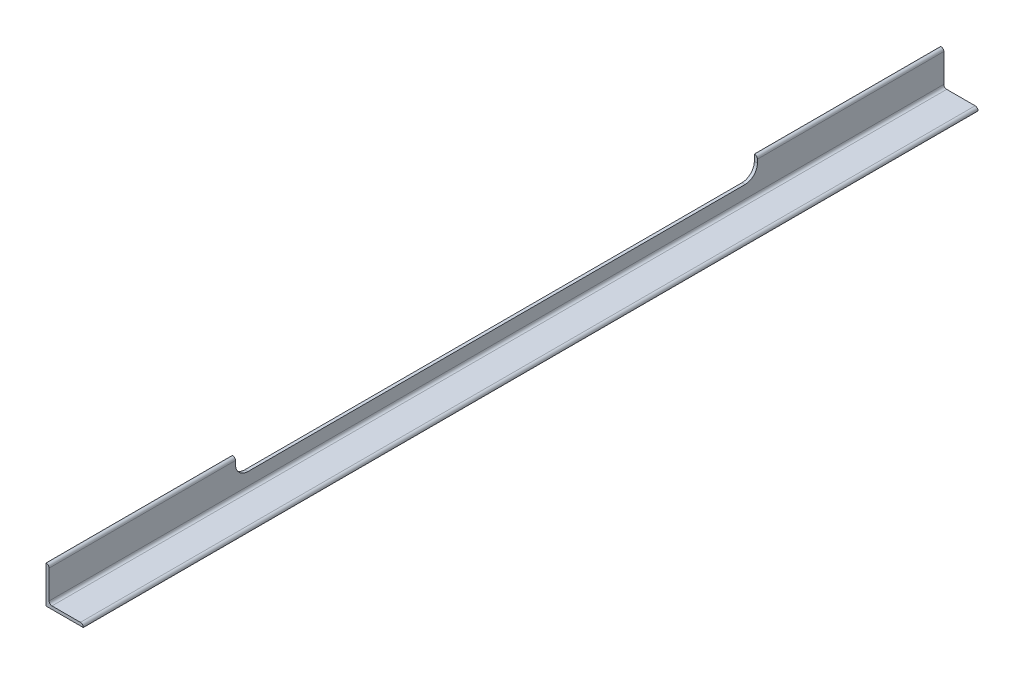
ISO-10303-21;
HEADER;
FILE_DESCRIPTION(('STEP AP214'),'2;1');
FILE_NAME('part.step','',(''),(''),'','','');
FILE_SCHEMA(('AUTOMOTIVE_DESIGN { 1 0 10303 214 1 1 1 1 }'));
ENDSEC;
DATA;
#1=APPLICATION_CONTEXT('core data for automotive mechanical design processes');
#2=APPLICATION_PROTOCOL_DEFINITION('international standard','automotive_design',2000,#1);
#3=PRODUCT_CONTEXT('',#1,'mechanical');
#4=PRODUCT('Part','Part','',(#3));
#5=PRODUCT_RELATED_PRODUCT_CATEGORY('part','',(#4));
#6=PRODUCT_DEFINITION_FORMATION('','',#4);
#7=PRODUCT_DEFINITION_CONTEXT('part definition',#1,'design');
#8=PRODUCT_DEFINITION('design','',#6,#7);
#9=PRODUCT_DEFINITION_SHAPE('','',#8);
#10=(LENGTH_UNIT() NAMED_UNIT(*) SI_UNIT(.MILLI.,.METRE.));
#11=(NAMED_UNIT(*) PLANE_ANGLE_UNIT() SI_UNIT($,.RADIAN.));
#12=(NAMED_UNIT(*) SI_UNIT($,.STERADIAN.) SOLID_ANGLE_UNIT());
#13=UNCERTAINTY_MEASURE_WITH_UNIT(LENGTH_MEASURE(1.E-05),#10,'distance_accuracy_value','');
#14=(GEOMETRIC_REPRESENTATION_CONTEXT(3) GLOBAL_UNCERTAINTY_ASSIGNED_CONTEXT((#13)) GLOBAL_UNIT_ASSIGNED_CONTEXT((#10,
#11,#12)) REPRESENTATION_CONTEXT('',''));
#15=CARTESIAN_POINT('',(0.,0.,0.));
#16=DIRECTION('',(0.,0.,1.));
#17=DIRECTION('',(1.,0.,0.));
#18=AXIS2_PLACEMENT_3D('',#15,#16,#17);
#19=CARTESIAN_POINT('',(0.508,70.358,4212.82368));
#20=DIRECTION('',(0.,0.,-1.));
#21=DIRECTION('',(-1.,0.,0.));
#22=AXIS2_PLACEMENT_3D('',#19,#20,#21);
#23=CYLINDRICAL_SURFACE('',#22,5.842);
#24=DIRECTION('',(0.,0.,-1.));
#25=VECTOR('',#24,1.);
#26=CARTESIAN_POINT('',(6.35,70.358,0.));
#27=LINE('',#26,#25);
#28=CARTESIAN_POINT('',(6.35,70.358,1447.8));
#29=VERTEX_POINT('',#28);
#30=CARTESIAN_POINT('',(6.35,70.358,1828.8));
#31=VERTEX_POINT('',#30);
#32=EDGE_CURVE('E140',#29,#31,#27,.F.);
#33=ORIENTED_EDGE('',*,*,#32,.F.);
#34=CARTESIAN_POINT('',(0.508,70.358,1447.8));
#35=DIRECTION('',(0.,0.,-1.));
#36=DIRECTION('',(-1.,0.,0.));
#37=AXIS2_PLACEMENT_3D('',#34,#35,#36);
#38=CIRCLE('',#37,5.842);
#39=CARTESIAN_POINT('',(0.508,76.2,1447.8));
#40=VERTEX_POINT('',#39);
#41=EDGE_CURVE('E20',#29,#40,#38,.F.);
#42=ORIENTED_EDGE('',*,*,#41,.T.);
#43=DIRECTION('',(0.,0.,1.));
#44=VECTOR('',#43,1.);
#45=CARTESIAN_POINT('',(0.508,76.2,0.));
#46=LINE('',#45,#44);
#47=CARTESIAN_POINT('',(0.508,76.2,1828.8));
#48=VERTEX_POINT('',#47);
#49=EDGE_CURVE('E138',#48,#40,#46,.F.);
#50=ORIENTED_EDGE('',*,*,#49,.F.);
#51=CARTESIAN_POINT('',(0.508,70.358,1828.8));
#52=DIRECTION('',(0.,0.,-1.));
#53=DIRECTION('',(-1.,0.,0.));
#54=AXIS2_PLACEMENT_3D('',#51,#52,#53);
#55=CIRCLE('',#54,5.842);
#56=EDGE_CURVE('E142',#31,#48,#55,.F.);
#57=ORIENTED_EDGE('',*,*,#56,.F.);
#58=EDGE_LOOP('',(#33,#42,#50,#57));
#59=FACE_BOUND('',#58,.T.);
#60=ADVANCED_FACE('F17',(#59),#23,.T.);
#61=CARTESIAN_POINT('',(6.35,76.2,0.));
#62=DIRECTION('',(0.,1.,0.));
#63=DIRECTION('',(0.,0.,1.));
#64=AXIS2_PLACEMENT_3D('',#61,#62,#63);
#65=PLANE('',#64);
#66=DIRECTION('',(0.,0.,1.));
#67=VECTOR('',#66,1.);
#68=CARTESIAN_POINT('',(0.,76.2,0.));
#69=LINE('',#68,#67);
#70=CARTESIAN_POINT('',(0.,76.2,381.));
#71=VERTEX_POINT('',#70);
#72=CARTESIAN_POINT('',(0.,76.2,0.));
#73=VERTEX_POINT('',#72);
#74=EDGE_CURVE('E194',#71,#73,#69,.F.);
#75=ORIENTED_EDGE('',*,*,#74,.F.);
#76=DIRECTION('',(-1.,0.,0.));
#77=VECTOR('',#76,1.);
#78=CARTESIAN_POINT('',(0.,76.2,381.));
#79=LINE('',#78,#77);
#80=CARTESIAN_POINT('',(0.508,76.2,381.));
#81=VERTEX_POINT('',#80);
#82=EDGE_CURVE('E187',#71,#81,#79,.F.);
#83=ORIENTED_EDGE('',*,*,#82,.T.);
#84=DIRECTION('',(0.,0.,-1.));
#85=VECTOR('',#84,1.);
#86=CARTESIAN_POINT('',(0.508,76.2,4212.82368));
#87=LINE('',#86,#85);
#88=CARTESIAN_POINT('',(0.508,76.2,0.));
#89=VERTEX_POINT('',#88);
#90=EDGE_CURVE('E184',#89,#81,#87,.F.);
#91=ORIENTED_EDGE('',*,*,#90,.F.);
#92=DIRECTION('',(1.,0.,0.));
#93=VECTOR('',#92,1.);
#94=CARTESIAN_POINT('',(6.35,76.2,0.));
#95=LINE('',#94,#93);
#96=EDGE_CURVE('E225',#89,#73,#95,.F.);
#97=ORIENTED_EDGE('',*,*,#96,.T.);
#98=EDGE_LOOP('',(#75,#83,#91,#97));
#99=FACE_BOUND('',#98,.T.);
#100=ADVANCED_FACE('F280',(#99),#65,.T.);
#101=CARTESIAN_POINT('',(6.35,76.2,0.));
#102=DIRECTION('',(0.,1.,0.));
#103=DIRECTION('',(0.,0.,1.));
#104=AXIS2_PLACEMENT_3D('',#101,#102,#103);
#105=PLANE('',#104);
#106=ORIENTED_EDGE('',*,*,#49,.T.);
#107=DIRECTION('',(1.,0.,0.));
#108=VECTOR('',#107,1.);
#109=CARTESIAN_POINT('',(0.,76.2,1447.8));
#110=LINE('',#109,#108);
#111=CARTESIAN_POINT('',(0.,76.2,1447.8));
#112=VERTEX_POINT('',#111);
#113=EDGE_CURVE('E135',#40,#112,#110,.F.);
#114=ORIENTED_EDGE('',*,*,#113,.T.);
#115=DIRECTION('',(0.,0.,1.));
#116=VECTOR('',#115,1.);
#117=CARTESIAN_POINT('',(0.,76.2,0.));
#118=LINE('',#117,#116);
#119=CARTESIAN_POINT('',(0.,76.2,1828.8));
#120=VERTEX_POINT('',#119);
#121=EDGE_CURVE('E207',#120,#112,#118,.F.);
#122=ORIENTED_EDGE('',*,*,#121,.F.);
#123=DIRECTION('',(1.,0.,0.));
#124=VECTOR('',#123,1.);
#125=CARTESIAN_POINT('',(0.,76.2,1828.8));
#126=LINE('',#125,#124);
#127=EDGE_CURVE('E174',#48,#120,#126,.F.);
#128=ORIENTED_EDGE('',*,*,#127,.F.);
#129=EDGE_LOOP('',(#106,#114,#122,#128));
#130=FACE_BOUND('',#129,.T.);
#131=ADVANCED_FACE('F311',(#130),#105,.T.);
#132=CARTESIAN_POINT('',(0.,63.5,1447.8));
#133=DIRECTION('',(0.,0.,1.));
#134=DIRECTION('',(1.,0.,0.));
#135=AXIS2_PLACEMENT_3D('',#132,#133,#134);
#136=PLANE('',#135);
#137=DIRECTION('',(0.,1.,0.));
#138=VECTOR('',#137,1.);
#139=CARTESIAN_POINT('',(0.,76.2,1447.8));
#140=LINE('',#139,#138);
#141=CARTESIAN_POINT('',(0.,63.5,1447.8));
#142=VERTEX_POINT('',#141);
#143=EDGE_CURVE('E210',#112,#142,#140,.F.);
#144=ORIENTED_EDGE('',*,*,#143,.F.);
#145=ORIENTED_EDGE('',*,*,#113,.F.);
#146=ORIENTED_EDGE('',*,*,#41,.F.);
#147=DIRECTION('',(0.,1.,0.));
#148=VECTOR('',#147,1.);
#149=CARTESIAN_POINT('',(6.35,6.35,1447.8));
#150=LINE('',#149,#148);
#151=CARTESIAN_POINT('',(6.35,63.5,1447.8));
#152=VERTEX_POINT('',#151);
#153=EDGE_CURVE('E133',#152,#29,#150,.T.);
#154=ORIENTED_EDGE('',*,*,#153,.F.);
#155=DIRECTION('',(-1.,0.,0.));
#156=VECTOR('',#155,1.);
#157=CARTESIAN_POINT('',(0.,63.5,1447.8));
#158=LINE('',#157,#156);
#159=EDGE_CURVE('E202',#152,#142,#158,.T.);
#160=ORIENTED_EDGE('',*,*,#159,.T.);
#161=EDGE_LOOP('',(#144,#145,#146,#154,#160));
#162=FACE_BOUND('',#161,.T.);
#163=ADVANCED_FACE('F131',(#162),#136,.F.);
#164=CARTESIAN_POINT('',(0.,63.5,1422.4));
#165=DIRECTION('',(-1.,0.,0.));
#166=DIRECTION('',(0.,0.,1.));
#167=AXIS2_PLACEMENT_3D('',#164,#165,#166);
#168=CYLINDRICAL_SURFACE('',#167,25.4);
#169=CARTESIAN_POINT('',(0.,63.5,1422.4));
#170=DIRECTION('',(-1.,0.,0.));
#171=DIRECTION('',(0.,0.,1.));
#172=AXIS2_PLACEMENT_3D('',#169,#170,#171);
#173=CIRCLE('',#172,25.4);
#174=CARTESIAN_POINT('',(0.,38.1,1422.4));
#175=VERTEX_POINT('',#174);
#176=EDGE_CURVE('E247',#142,#175,#173,.F.);
#177=ORIENTED_EDGE('',*,*,#176,.F.);
#178=ORIENTED_EDGE('',*,*,#159,.F.);
#179=CARTESIAN_POINT('',(6.35,63.5,1422.4));
#180=DIRECTION('',(-1.,0.,0.));
#181=DIRECTION('',(0.,0.,1.));
#182=AXIS2_PLACEMENT_3D('',#179,#180,#181);
#183=CIRCLE('',#182,25.4);
#184=CARTESIAN_POINT('',(6.35,38.1,1422.4));
#185=VERTEX_POINT('',#184);
#186=EDGE_CURVE('E152',#185,#152,#183,.T.);
#187=ORIENTED_EDGE('',*,*,#186,.F.);
#188=DIRECTION('',(1.,0.,0.));
#189=VECTOR('',#188,1.);
#190=CARTESIAN_POINT('',(0.,38.1,1422.4));
#191=LINE('',#190,#189);
#192=EDGE_CURVE('E200',#185,#175,#191,.F.);
#193=ORIENTED_EDGE('',*,*,#192,.T.);
#194=EDGE_LOOP('',(#177,#178,#187,#193));
#195=FACE_BOUND('',#194,.T.);
#196=ADVANCED_FACE('F439',(#195),#168,.F.);
#197=CARTESIAN_POINT('',(0.,38.1,406.4));
#198=DIRECTION('',(0.,-1.,0.));
#199=DIRECTION('',(0.,0.,-1.));
#200=AXIS2_PLACEMENT_3D('',#197,#198,#199);
#201=PLANE('',#200);
#202=DIRECTION('',(0.,0.,1.));
#203=VECTOR('',#202,1.);
#204=CARTESIAN_POINT('',(0.,38.1,0.));
#205=LINE('',#204,#203);
#206=CARTESIAN_POINT('',(0.,38.1,406.4));
#207=VERTEX_POINT('',#206);
#208=EDGE_CURVE('E246',#175,#207,#205,.F.);
#209=ORIENTED_EDGE('',*,*,#208,.F.);
#210=ORIENTED_EDGE('',*,*,#192,.F.);
#211=DIRECTION('',(0.,0.,-1.));
#212=VECTOR('',#211,1.);
#213=CARTESIAN_POINT('',(6.35,38.1,0.));
#214=LINE('',#213,#212);
#215=CARTESIAN_POINT('',(6.35,38.1,406.4));
#216=VERTEX_POINT('',#215);
#217=EDGE_CURVE('E154',#216,#185,#214,.F.);
#218=ORIENTED_EDGE('',*,*,#217,.F.);
#219=DIRECTION('',(-1.,0.,0.));
#220=VECTOR('',#219,1.);
#221=CARTESIAN_POINT('',(0.,38.1,406.4));
#222=LINE('',#221,#220);
#223=EDGE_CURVE('E193',#216,#207,#222,.T.);
#224=ORIENTED_EDGE('',*,*,#223,.T.);
#225=EDGE_LOOP('',(#209,#210,#218,#224));
#226=FACE_BOUND('',#225,.T.);
#227=ADVANCED_FACE('F430',(#226),#201,.F.);
#228=CARTESIAN_POINT('',(0.,63.5,406.4));
#229=DIRECTION('',(-1.,0.,0.));
#230=DIRECTION('',(0.,0.,1.));
#231=AXIS2_PLACEMENT_3D('',#228,#229,#230);
#232=CYLINDRICAL_SURFACE('',#231,25.4);
#233=CARTESIAN_POINT('',(0.,63.5,406.4));
#234=DIRECTION('',(-1.,0.,0.));
#235=DIRECTION('',(0.,0.,1.));
#236=AXIS2_PLACEMENT_3D('',#233,#234,#235);
#237=CIRCLE('',#236,25.4);
#238=CARTESIAN_POINT('',(0.,63.5,381.));
#239=VERTEX_POINT('',#238);
#240=EDGE_CURVE('E243',#207,#239,#237,.F.);
#241=ORIENTED_EDGE('',*,*,#240,.F.);
#242=ORIENTED_EDGE('',*,*,#223,.F.);
#243=CARTESIAN_POINT('',(6.35,63.5,406.4));
#244=DIRECTION('',(-1.,0.,0.));
#245=DIRECTION('',(0.,0.,1.));
#246=AXIS2_PLACEMENT_3D('',#243,#244,#245);
#247=CIRCLE('',#246,25.4);
#248=CARTESIAN_POINT('',(6.35,63.5,381.));
#249=VERTEX_POINT('',#248);
#250=EDGE_CURVE('E161',#249,#216,#247,.T.);
#251=ORIENTED_EDGE('',*,*,#250,.F.);
#252=DIRECTION('',(-1.,0.,0.));
#253=VECTOR('',#252,1.);
#254=CARTESIAN_POINT('',(0.,63.5,381.));
#255=LINE('',#254,#253);
#256=EDGE_CURVE('E189',#249,#239,#255,.T.);
#257=ORIENTED_EDGE('',*,*,#256,.T.);
#258=EDGE_LOOP('',(#241,#242,#251,#257));
#259=FACE_BOUND('',#258,.T.);
#260=ADVANCED_FACE('F422',(#259),#232,.F.);
#261=CARTESIAN_POINT('',(0.,76.2,381.));
#262=DIRECTION('',(0.,0.,-1.));
#263=DIRECTION('',(-1.,0.,0.));
#264=AXIS2_PLACEMENT_3D('',#261,#262,#263);
#265=PLANE('',#264);
#266=ORIENTED_EDGE('',*,*,#82,.F.);
#267=DIRECTION('',(0.,1.,0.));
#268=VECTOR('',#267,1.);
#269=CARTESIAN_POINT('',(0.,76.2,381.));
#270=LINE('',#269,#268);
#271=EDGE_CURVE('E242',#239,#71,#270,.T.);
#272=ORIENTED_EDGE('',*,*,#271,.F.);
#273=ORIENTED_EDGE('',*,*,#256,.F.);
#274=DIRECTION('',(0.,1.,0.));
#275=VECTOR('',#274,1.);
#276=CARTESIAN_POINT('',(6.35,6.35,381.));
#277=LINE('',#276,#275);
#278=CARTESIAN_POINT('',(6.35,70.358,381.));
#279=VERTEX_POINT('',#278);
#280=EDGE_CURVE('E158',#279,#249,#277,.F.);
#281=ORIENTED_EDGE('',*,*,#280,.F.);
#282=CARTESIAN_POINT('',(0.508,70.358,381.));
#283=DIRECTION('',(0.,0.,-1.));
#284=DIRECTION('',(-1.,0.,0.));
#285=AXIS2_PLACEMENT_3D('',#282,#283,#284);
#286=CIRCLE('',#285,5.842);
#287=EDGE_CURVE('E171',#81,#279,#286,.T.);
#288=ORIENTED_EDGE('',*,*,#287,.F.);
#289=EDGE_LOOP('',(#266,#272,#273,#281,#288));
#290=FACE_BOUND('',#289,.T.);
#291=ADVANCED_FACE('F271',(#290),#265,.F.);
#292=CARTESIAN_POINT('',(0.508,70.358,4212.82368));
#293=DIRECTION('',(0.,0.,-1.));
#294=DIRECTION('',(-1.,0.,0.));
#295=AXIS2_PLACEMENT_3D('',#292,#293,#294);
#296=CYLINDRICAL_SURFACE('',#295,5.842);
#297=ORIENTED_EDGE('',*,*,#90,.T.);
#298=ORIENTED_EDGE('',*,*,#287,.T.);
#299=DIRECTION('',(0.,0.,-1.));
#300=VECTOR('',#299,1.);
#301=CARTESIAN_POINT('',(6.35,70.358,0.));
#302=LINE('',#301,#300);
#303=CARTESIAN_POINT('',(6.35,70.358,0.));
#304=VERTEX_POINT('',#303);
#305=EDGE_CURVE('E164',#304,#279,#302,.F.);
#306=ORIENTED_EDGE('',*,*,#305,.F.);
#307=CARTESIAN_POINT('',(0.508,70.358,0.));
#308=DIRECTION('',(0.,0.,-1.));
#309=DIRECTION('',(-1.,0.,0.));
#310=AXIS2_PLACEMENT_3D('',#307,#308,#309);
#311=CIRCLE('',#310,5.842);
#312=EDGE_CURVE('E231',#304,#89,#311,.F.);
#313=ORIENTED_EDGE('',*,*,#312,.T.);
#314=EDGE_LOOP('',(#297,#298,#306,#313));
#315=FACE_BOUND('',#314,.T.);
#316=ADVANCED_FACE('F264',(#315),#296,.T.);
#317=CARTESIAN_POINT('',(70.358,0.508,4212.82368));
#318=DIRECTION('',(0.,0.,-1.));
#319=DIRECTION('',(-1.,0.,0.));
#320=AXIS2_PLACEMENT_3D('',#317,#318,#319);
#321=CYLINDRICAL_SURFACE('',#320,5.842);
#322=DIRECTION('',(0.,0.,-1.));
#323=VECTOR('',#322,1.);
#324=CARTESIAN_POINT('',(76.2,0.508,0.));
#325=LINE('',#324,#323);
#326=CARTESIAN_POINT('',(76.2,0.508,0.));
#327=VERTEX_POINT('',#326);
#328=CARTESIAN_POINT('',(76.2,0.508,1828.8));
#329=VERTEX_POINT('',#328);
#330=EDGE_CURVE('E172',#327,#329,#325,.F.);
#331=ORIENTED_EDGE('',*,*,#330,.F.);
#332=CARTESIAN_POINT('',(70.358,0.508,0.));
#333=DIRECTION('',(0.,0.,-1.));
#334=DIRECTION('',(-1.,0.,0.));
#335=AXIS2_PLACEMENT_3D('',#332,#333,#334);
#336=CIRCLE('',#335,5.842);
#337=CARTESIAN_POINT('',(70.358,6.35,0.));
#338=VERTEX_POINT('',#337);
#339=EDGE_CURVE('E238',#327,#338,#336,.F.);
#340=ORIENTED_EDGE('',*,*,#339,.T.);
#341=DIRECTION('',(0.,0.,1.));
#342=VECTOR('',#341,1.);
#343=CARTESIAN_POINT('',(70.358,6.35,0.));
#344=LINE('',#343,#342);
#345=CARTESIAN_POINT('',(70.358,6.35,1828.8));
#346=VERTEX_POINT('',#345);
#347=EDGE_CURVE('E168',#346,#338,#344,.F.);
#348=ORIENTED_EDGE('',*,*,#347,.F.);
#349=CARTESIAN_POINT('',(70.358,0.508,1828.8));
#350=DIRECTION('',(0.,0.,-1.));
#351=DIRECTION('',(-1.,0.,0.));
#352=AXIS2_PLACEMENT_3D('',#349,#350,#351);
#353=CIRCLE('',#352,5.842);
#354=EDGE_CURVE('E256',#329,#346,#353,.F.);
#355=ORIENTED_EDGE('',*,*,#354,.F.);
#356=EDGE_LOOP('',(#331,#340,#348,#355));
#357=FACE_BOUND('',#356,.T.);
#358=ADVANCED_FACE('F321',(#357),#321,.T.);
#359=CARTESIAN_POINT('',(76.2,6.35,0.));
#360=DIRECTION('',(0.,1.,0.));
#361=DIRECTION('',(0.,0.,1.));
#362=AXIS2_PLACEMENT_3D('',#359,#360,#361);
#363=PLANE('',#362);
#364=DIRECTION('',(1.,0.,0.));
#365=VECTOR('',#364,1.);
#366=CARTESIAN_POINT('',(0.,6.35,1828.8));
#367=LINE('',#366,#365);
#368=CARTESIAN_POINT('',(12.192,6.35,1828.8));
#369=VERTEX_POINT('',#368);
#370=EDGE_CURVE('E255',#346,#369,#367,.F.);
#371=ORIENTED_EDGE('',*,*,#370,.F.);
#372=ORIENTED_EDGE('',*,*,#347,.T.);
#373=DIRECTION('',(1.,0.,0.));
#374=VECTOR('',#373,1.);
#375=CARTESIAN_POINT('',(0.,6.35,0.));
#376=LINE('',#375,#374);
#377=CARTESIAN_POINT('',(12.192,6.35,0.));
#378=VERTEX_POINT('',#377);
#379=EDGE_CURVE('E237',#338,#378,#376,.F.);
#380=ORIENTED_EDGE('',*,*,#379,.T.);
#381=DIRECTION('',(0.,0.,1.));
#382=VECTOR('',#381,1.);
#383=CARTESIAN_POINT('',(12.192,6.35,-2384.02368));
#384=LINE('',#383,#382);
#385=EDGE_CURVE('E166',#378,#369,#384,.T.);
#386=ORIENTED_EDGE('',*,*,#385,.T.);
#387=EDGE_LOOP('',(#371,#372,#380,#386));
#388=FACE_BOUND('',#387,.T.);
#389=ADVANCED_FACE('F325',(#388),#363,.T.);
#390=CARTESIAN_POINT('',(12.192,12.192,-2384.02368));
#391=DIRECTION('',(0.,0.,1.));
#392=DIRECTION('',(1.,0.,0.));
#393=AXIS2_PLACEMENT_3D('',#390,#391,#392);
#394=CYLINDRICAL_SURFACE('',#393,5.842);
#395=ORIENTED_EDGE('',*,*,#385,.F.);
#396=CARTESIAN_POINT('',(12.192,12.192,0.));
#397=DIRECTION('',(0.,0.,1.));
#398=DIRECTION('',(1.,0.,0.));
#399=AXIS2_PLACEMENT_3D('',#396,#397,#398);
#400=CIRCLE('',#399,5.842);
#401=CARTESIAN_POINT('',(6.35,12.192,0.));
#402=VERTEX_POINT('',#401);
#403=EDGE_CURVE('E235',#378,#402,#400,.F.);
#404=ORIENTED_EDGE('',*,*,#403,.T.);
#405=DIRECTION('',(0.,0.,-1.));
#406=VECTOR('',#405,1.);
#407=CARTESIAN_POINT('',(6.35,12.192,0.));
#408=LINE('',#407,#406);
#409=CARTESIAN_POINT('',(6.35,12.192,1828.8));
#410=VERTEX_POINT('',#409);
#411=EDGE_CURVE('E146',#410,#402,#408,.T.);
#412=ORIENTED_EDGE('',*,*,#411,.F.);
#413=CARTESIAN_POINT('',(12.192,12.192,1828.8));
#414=DIRECTION('',(0.,0.,1.));
#415=DIRECTION('',(1.,0.,0.));
#416=AXIS2_PLACEMENT_3D('',#413,#414,#415);
#417=CIRCLE('',#416,5.842);
#418=EDGE_CURVE('E252',#369,#410,#417,.F.);
#419=ORIENTED_EDGE('',*,*,#418,.F.);
#420=EDGE_LOOP('',(#395,#404,#412,#419));
#421=FACE_BOUND('',#420,.T.);
#422=ADVANCED_FACE('F329',(#421),#394,.F.);
#423=CARTESIAN_POINT('',(6.35,6.35,0.));
#424=DIRECTION('',(1.,0.,0.));
#425=DIRECTION('',(0.,0.,-1.));
#426=AXIS2_PLACEMENT_3D('',#423,#424,#425);
#427=PLANE('',#426);
#428=ORIENTED_EDGE('',*,*,#305,.T.);
#429=ORIENTED_EDGE('',*,*,#280,.T.);
#430=ORIENTED_EDGE('',*,*,#250,.T.);
#431=ORIENTED_EDGE('',*,*,#217,.T.);
#432=ORIENTED_EDGE('',*,*,#186,.T.);
#433=ORIENTED_EDGE('',*,*,#153,.T.);
#434=ORIENTED_EDGE('',*,*,#32,.T.);
#435=DIRECTION('',(0.,1.,0.));
#436=VECTOR('',#435,1.);
#437=CARTESIAN_POINT('',(6.35,0.,1828.8));
#438=LINE('',#437,#436);
#439=EDGE_CURVE('E251',#410,#31,#438,.T.);
#440=ORIENTED_EDGE('',*,*,#439,.F.);
#441=ORIENTED_EDGE('',*,*,#411,.T.);
#442=DIRECTION('',(0.,1.,0.));
#443=VECTOR('',#442,1.);
#444=CARTESIAN_POINT('',(6.35,0.,0.));
#445=LINE('',#444,#443);
#446=EDGE_CURVE('E179',#402,#304,#445,.T.);
#447=ORIENTED_EDGE('',*,*,#446,.T.);
#448=EDGE_LOOP('',(#428,#429,#430,#431,#432,#433,#434,#440,#441,#447));
#449=FACE_BOUND('',#448,.T.);
#450=ADVANCED_FACE('F149',(#449),#427,.T.);
#451=CARTESIAN_POINT('',(76.2,0.,0.));
#452=DIRECTION('',(1.,0.,0.));
#453=DIRECTION('',(0.,0.,-1.));
#454=AXIS2_PLACEMENT_3D('',#451,#452,#453);
#455=PLANE('',#454);
#456=DIRECTION('',(0.,1.,0.));
#457=VECTOR('',#456,1.);
#458=CARTESIAN_POINT('',(76.2,0.,0.));
#459=LINE('',#458,#457);
#460=CARTESIAN_POINT('',(76.2,0.,0.));
#461=VERTEX_POINT('',#460);
#462=EDGE_CURVE('E230',#461,#327,#459,.T.);
#463=ORIENTED_EDGE('',*,*,#462,.T.);
#464=ORIENTED_EDGE('',*,*,#330,.T.);
#465=DIRECTION('',(0.,1.,0.));
#466=VECTOR('',#465,1.);
#467=CARTESIAN_POINT('',(76.2,0.,1828.8));
#468=LINE('',#467,#466);
#469=CARTESIAN_POINT('',(76.2,0.,1828.8));
#470=VERTEX_POINT('',#469);
#471=EDGE_CURVE('E258',#470,#329,#468,.T.);
#472=ORIENTED_EDGE('',*,*,#471,.F.);
#473=DIRECTION('',(0.,0.,-1.));
#474=VECTOR('',#473,1.);
#475=CARTESIAN_POINT('',(76.2,0.,0.));
#476=LINE('',#475,#474);
#477=EDGE_CURVE('E175',#461,#470,#476,.F.);
#478=ORIENTED_EDGE('',*,*,#477,.F.);
#479=EDGE_LOOP('',(#463,#464,#472,#478));
#480=FACE_BOUND('',#479,.T.);
#481=ADVANCED_FACE('F317',(#480),#455,.T.);
#482=CARTESIAN_POINT('',(0.,0.,1828.8));
#483=DIRECTION('',(0.,0.,1.));
#484=DIRECTION('',(1.,0.,0.));
#485=AXIS2_PLACEMENT_3D('',#482,#483,#484);
#486=PLANE('',#485);
#487=ORIENTED_EDGE('',*,*,#439,.T.);
#488=ORIENTED_EDGE('',*,*,#56,.T.);
#489=ORIENTED_EDGE('',*,*,#127,.T.);
#490=DIRECTION('',(0.,1.,0.));
#491=VECTOR('',#490,1.);
#492=CARTESIAN_POINT('',(0.,76.2,1828.8));
#493=LINE('',#492,#491);
#494=CARTESIAN_POINT('',(0.,0.,1828.8));
#495=VERTEX_POINT('',#494);
#496=EDGE_CURVE('E196',#495,#120,#493,.T.);
#497=ORIENTED_EDGE('',*,*,#496,.F.);
#498=DIRECTION('',(1.,0.,0.));
#499=VECTOR('',#498,1.);
#500=CARTESIAN_POINT('',(0.,0.,1828.8));
#501=LINE('',#500,#499);
#502=EDGE_CURVE('E178',#470,#495,#501,.F.);
#503=ORIENTED_EDGE('',*,*,#502,.F.);
#504=ORIENTED_EDGE('',*,*,#471,.T.);
#505=ORIENTED_EDGE('',*,*,#354,.T.);
#506=ORIENTED_EDGE('',*,*,#370,.T.);
#507=ORIENTED_EDGE('',*,*,#418,.T.);
#508=EDGE_LOOP('',(#487,#488,#489,#497,#503,#504,#505,#506,#507));
#509=FACE_BOUND('',#508,.T.);
#510=ADVANCED_FACE('F308',(#509),#486,.T.);
#511=CARTESIAN_POINT('',(0.,76.2,0.));
#512=DIRECTION('',(-1.,0.,0.));
#513=DIRECTION('',(0.,0.,1.));
#514=AXIS2_PLACEMENT_3D('',#511,#512,#513);
#515=PLANE('',#514);
#516=ORIENTED_EDGE('',*,*,#240,.T.);
#517=ORIENTED_EDGE('',*,*,#271,.T.);
#518=ORIENTED_EDGE('',*,*,#74,.T.);
#519=DIRECTION('',(0.,1.,0.));
#520=VECTOR('',#519,1.);
#521=CARTESIAN_POINT('',(0.,0.,0.));
#522=LINE('',#521,#520);
#523=CARTESIAN_POINT('',(0.,0.,0.));
#524=VERTEX_POINT('',#523);
#525=EDGE_CURVE('E35',#73,#524,#522,.F.);
#526=ORIENTED_EDGE('',*,*,#525,.T.);
#527=DIRECTION('',(0.,0.,-1.));
#528=VECTOR('',#527,1.);
#529=CARTESIAN_POINT('',(0.,0.,0.));
#530=LINE('',#529,#528);
#531=EDGE_CURVE('E26',#495,#524,#530,.T.);
#532=ORIENTED_EDGE('',*,*,#531,.F.);
#533=ORIENTED_EDGE('',*,*,#496,.T.);
#534=ORIENTED_EDGE('',*,*,#121,.T.);
#535=ORIENTED_EDGE('',*,*,#143,.T.);
#536=ORIENTED_EDGE('',*,*,#176,.T.);
#537=ORIENTED_EDGE('',*,*,#208,.T.);
#538=EDGE_LOOP('',(#516,#517,#518,#526,#532,#533,#534,#535,#536,#537));
#539=FACE_BOUND('',#538,.T.);
#540=ADVANCED_FACE('F282',(#539),#515,.T.);
#541=CARTESIAN_POINT('',(0.,0.,0.));
#542=DIRECTION('',(0.,0.,1.));
#543=DIRECTION('',(1.,0.,0.));
#544=AXIS2_PLACEMENT_3D('',#541,#542,#543);
#545=PLANE('',#544);
#546=ORIENTED_EDGE('',*,*,#403,.F.);
#547=ORIENTED_EDGE('',*,*,#379,.F.);
#548=ORIENTED_EDGE('',*,*,#339,.F.);
#549=ORIENTED_EDGE('',*,*,#462,.F.);
#550=DIRECTION('',(1.,0.,0.));
#551=VECTOR('',#550,1.);
#552=CARTESIAN_POINT('',(0.,0.,0.));
#553=LINE('',#552,#551);
#554=EDGE_CURVE('E11',#524,#461,#553,.T.);
#555=ORIENTED_EDGE('',*,*,#554,.F.);
#556=ORIENTED_EDGE('',*,*,#525,.F.);
#557=ORIENTED_EDGE('',*,*,#96,.F.);
#558=ORIENTED_EDGE('',*,*,#312,.F.);
#559=ORIENTED_EDGE('',*,*,#446,.F.);
#560=EDGE_LOOP('',(#546,#547,#548,#549,#555,#556,#557,#558,#559));
#561=FACE_BOUND('',#560,.T.);
#562=ADVANCED_FACE('F278',(#561),#545,.F.);
#563=CARTESIAN_POINT('',(0.,0.,0.));
#564=DIRECTION('',(0.,-1.,0.));
#565=DIRECTION('',(0.,0.,-1.));
#566=AXIS2_PLACEMENT_3D('',#563,#564,#565);
#567=PLANE('',#566);
#568=ORIENTED_EDGE('',*,*,#531,.T.);
#569=ORIENTED_EDGE('',*,*,#554,.T.);
#570=ORIENTED_EDGE('',*,*,#477,.T.);
#571=ORIENTED_EDGE('',*,*,#502,.T.);
#572=EDGE_LOOP('',(#568,#569,#570,#571));
#573=FACE_BOUND('',#572,.T.);
#574=ADVANCED_FACE('F313',(#573),#567,.T.);
#575=CLOSED_SHELL('',(#60,#100,#131,#163,#196,#227,#260,#291,#316,#358,#389,#422,#450,#481,#510,
#540,#562,#574));
#576=MANIFOLD_SOLID_BREP('B1',#575);
#577=ADVANCED_BREP_SHAPE_REPRESENTATION('',(#18,#576),#14);
#578=SHAPE_DEFINITION_REPRESENTATION(#9,#577);
ENDSEC;
END-ISO-10303-21;
